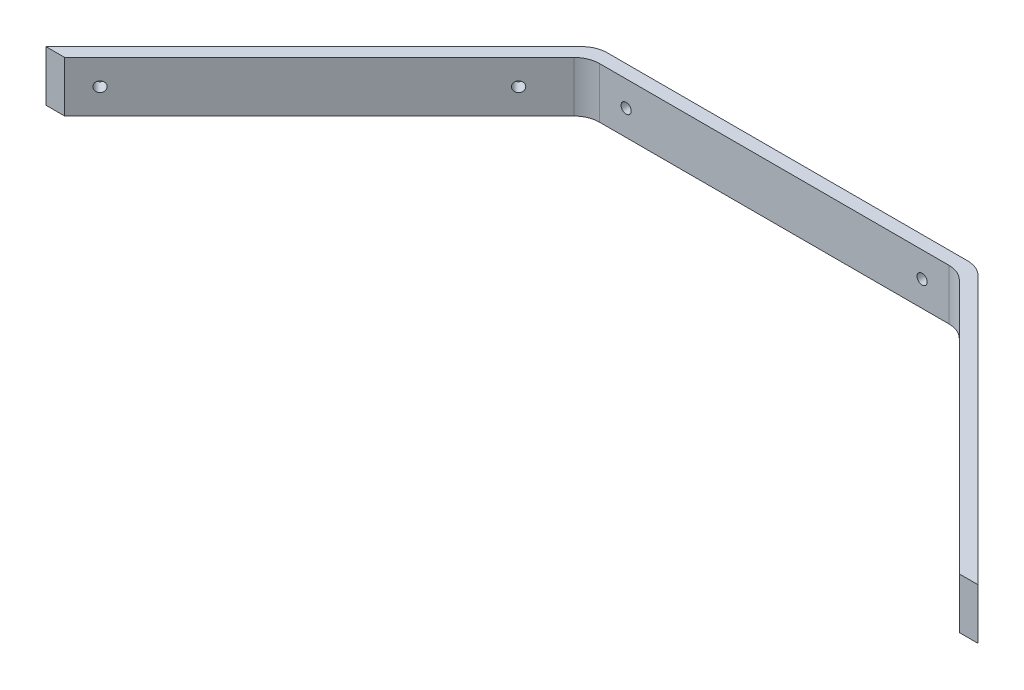
ISO-10303-21;
HEADER;
FILE_DESCRIPTION(('STEP AP214'),'2;1');
FILE_NAME('part.step','',(''),(''),'','','');
FILE_SCHEMA(('AUTOMOTIVE_DESIGN { 1 0 10303 214 1 1 1 1 }'));
ENDSEC;
DATA;
#1=APPLICATION_CONTEXT('core data for automotive mechanical design processes');
#2=APPLICATION_PROTOCOL_DEFINITION('international standard','automotive_design',2000,#1);
#3=PRODUCT_CONTEXT('',#1,'mechanical');
#4=PRODUCT('Part','Part','',(#3));
#5=PRODUCT_RELATED_PRODUCT_CATEGORY('part','',(#4));
#6=PRODUCT_DEFINITION_FORMATION('','',#4);
#7=PRODUCT_DEFINITION_CONTEXT('part definition',#1,'design');
#8=PRODUCT_DEFINITION('design','',#6,#7);
#9=PRODUCT_DEFINITION_SHAPE('','',#8);
#10=(LENGTH_UNIT() NAMED_UNIT(*) SI_UNIT(.MILLI.,.METRE.));
#11=(NAMED_UNIT(*) PLANE_ANGLE_UNIT() SI_UNIT($,.RADIAN.));
#12=(NAMED_UNIT(*) SI_UNIT($,.STERADIAN.) SOLID_ANGLE_UNIT());
#13=UNCERTAINTY_MEASURE_WITH_UNIT(LENGTH_MEASURE(1.E-05),#10,'distance_accuracy_value','');
#14=(GEOMETRIC_REPRESENTATION_CONTEXT(3) GLOBAL_UNCERTAINTY_ASSIGNED_CONTEXT((#13)) GLOBAL_UNIT_ASSIGNED_CONTEXT((#10,
#11,#12)) REPRESENTATION_CONTEXT('',''));
#15=CARTESIAN_POINT('',(0.,0.,0.));
#16=DIRECTION('',(0.,0.,1.));
#17=DIRECTION('',(1.,0.,0.));
#18=AXIS2_PLACEMENT_3D('',#15,#16,#17);
#19=CARTESIAN_POINT('',(23.1530667042611,-3.175,0.8255));
#20=DIRECTION('',(-0.707106781186549,0.,0.707106781186546));
#21=DIRECTION('',(0.707106781186546,0.,0.707106781186549));
#22=AXIS2_PLACEMENT_3D('',#19,#20,#21);
#23=PLANE('',#22);
#24=CARTESIAN_POINT('',(27.5478777942762,0.,5.22031109001511));
#25=DIRECTION('',(-0.707106781186549,0.,0.707106781186546));
#26=DIRECTION('',(0.707106781186546,0.,0.707106781186549));
#27=AXIS2_PLACEMENT_3D('',#24,#25,#26);
#28=CIRCLE('',#27,0.635000000000001);
#29=CARTESIAN_POINT('',(27.9968906003297,0.,5.66932389606857));
#30=VERTEX_POINT('',#29);
#31=EDGE_CURVE('E254',#30,#30,#28,.F.);
#32=ORIENTED_EDGE('',*,*,#31,.T.);
#33=EDGE_LOOP('',(#32));
#34=FACE_BOUND('',#33,.T.);
#35=DIRECTION('',(0.,-1.,0.));
#36=VECTOR('',#35,1.);
#37=CARTESIAN_POINT('',(55.919066704261,-3.175,33.5915));
#38=LINE('',#37,#36);
#39=CARTESIAN_POINT('',(55.919066704261,3.175,33.5915));
#40=VERTEX_POINT('',#39);
#41=CARTESIAN_POINT('',(55.919066704261,-3.175,33.5915));
#42=VERTEX_POINT('',#41);
#43=EDGE_CURVE('E122',#40,#42,#38,.T.);
#44=ORIENTED_EDGE('',*,*,#43,.F.);
#45=DIRECTION('',(0.707106781186546,0.,0.707106781186549));
#46=VECTOR('',#45,1.);
#47=CARTESIAN_POINT('',(23.1530667042611,3.175,0.8255));
#48=LINE('',#47,#46);
#49=CARTESIAN_POINT('',(24.0830026739939,3.175,1.75543596973271));
#50=VERTEX_POINT('',#49);
#51=EDGE_CURVE('E152',#50,#40,#48,.T.);
#52=ORIENTED_EDGE('',*,*,#51,.F.);
#53=DIRECTION('',(0.,-1.,0.));
#54=VECTOR('',#53,1.);
#55=CARTESIAN_POINT('',(24.0830026739939,-3.175,1.75543596973272));
#56=LINE('',#55,#54);
#57=CARTESIAN_POINT('',(24.0830026739939,-3.175,1.75543596973271));
#58=VERTEX_POINT('',#57);
#59=EDGE_CURVE('E147',#50,#58,#56,.T.);
#60=ORIENTED_EDGE('',*,*,#59,.T.);
#61=DIRECTION('',(0.707106781186546,0.,0.707106781186549));
#62=VECTOR('',#61,1.);
#63=CARTESIAN_POINT('',(23.1530667042611,-3.175,0.8255));
#64=LINE('',#63,#62);
#65=EDGE_CURVE('E208',#58,#42,#64,.T.);
#66=ORIENTED_EDGE('',*,*,#65,.T.);
#67=EDGE_LOOP('',(#44,#52,#60,#66));
#68=FACE_BOUND('',#67,.T.);
#69=CARTESIAN_POINT('',(53.7108286981784,0.,31.3832619939174));
#70=DIRECTION('',(-0.707106781186549,0.,0.707106781186546));
#71=DIRECTION('',(0.707106781186546,0.,0.707106781186549));
#72=AXIS2_PLACEMENT_3D('',#69,#70,#71);
#73=CIRCLE('',#72,0.634999999999996);
#74=CARTESIAN_POINT('',(54.1598415042319,0.,31.8322747999709));
#75=VERTEX_POINT('',#74);
#76=EDGE_CURVE('E260',#75,#75,#73,.F.);
#77=ORIENTED_EDGE('',*,*,#76,.T.);
#78=EDGE_LOOP('',(#77));
#79=FACE_BOUND('',#78,.T.);
#80=ADVANCED_FACE('F33',(#34,#68,#79),#23,.T.);
#81=CARTESIAN_POINT('',(23.8369332957391,-3.175,-0.825499999999999));
#82=DIRECTION('',(0.707106781186549,0.,-0.707106781186546));
#83=DIRECTION('',(-0.707106781186546,0.,-0.707106781186549));
#84=AXIS2_PLACEMENT_3D('',#81,#82,#83);
#85=PLANE('',#84);
#86=CARTESIAN_POINT('',(28.7153110900152,0.,4.05287779427612));
#87=DIRECTION('',(-0.707106781186549,0.,0.707106781186546));
#88=DIRECTION('',(0.707106781186546,0.,0.707106781186549));
#89=AXIS2_PLACEMENT_3D('',#86,#87,#88);
#90=CIRCLE('',#89,0.635000000000001);
#91=CARTESIAN_POINT('',(29.1643238960687,0.,4.50189060032958));
#92=VERTEX_POINT('',#91);
#93=EDGE_CURVE('E257',#92,#92,#90,.T.);
#94=ORIENTED_EDGE('',*,*,#93,.T.);
#95=EDGE_LOOP('',(#94));
#96=FACE_BOUND('',#95,.T.);
#97=DIRECTION('',(0.,-1.,0.));
#98=VECTOR('',#97,1.);
#99=CARTESIAN_POINT('',(58.2539332957391,162.970021260659,33.5915));
#100=LINE('',#99,#98);
#101=CARTESIAN_POINT('',(58.253933295739,3.175,33.5915));
#102=VERTEX_POINT('',#101);
#103=CARTESIAN_POINT('',(58.2539332957391,-3.17500000000001,33.5915));
#104=VERTEX_POINT('',#103);
#105=EDGE_CURVE('E48',#102,#104,#100,.T.);
#106=ORIENTED_EDGE('',*,*,#105,.T.);
#107=DIRECTION('',(0.707106781186546,0.,0.707106781186549));
#108=VECTOR('',#107,1.);
#109=CARTESIAN_POINT('',(23.8369332957391,-3.175,-0.825499999999999));
#110=LINE('',#109,#108);
#111=CARTESIAN_POINT('',(24.7668692654718,-3.175,0.104435969732715));
#112=VERTEX_POINT('',#111);
#113=EDGE_CURVE('E136',#112,#104,#110,.T.);
#114=ORIENTED_EDGE('',*,*,#113,.F.);
#115=DIRECTION('',(0.,1.,0.));
#116=VECTOR('',#115,1.);
#117=CARTESIAN_POINT('',(24.7668692654718,3.175,0.104435969732715));
#118=LINE('',#117,#116);
#119=CARTESIAN_POINT('',(24.7668692654718,3.175,0.104435969732715));
#120=VERTEX_POINT('',#119);
#121=EDGE_CURVE('E170',#112,#120,#118,.T.);
#122=ORIENTED_EDGE('',*,*,#121,.T.);
#123=DIRECTION('',(0.707106781186546,0.,0.707106781186549));
#124=VECTOR('',#123,1.);
#125=CARTESIAN_POINT('',(23.8369332957391,3.175,-0.825499999999999));
#126=LINE('',#125,#124);
#127=EDGE_CURVE('E139',#120,#102,#126,.T.);
#128=ORIENTED_EDGE('',*,*,#127,.T.);
#129=EDGE_LOOP('',(#106,#114,#122,#128));
#130=FACE_BOUND('',#129,.T.);
#131=CARTESIAN_POINT('',(54.8782619939174,0.,30.2158286981784));
#132=DIRECTION('',(-0.707106781186549,0.,0.707106781186546));
#133=DIRECTION('',(0.707106781186546,0.,0.707106781186549));
#134=AXIS2_PLACEMENT_3D('',#131,#132,#133);
#135=CIRCLE('',#134,0.634999999999996);
#136=CARTESIAN_POINT('',(55.3272747999709,0.,30.6648415042319));
#137=VERTEX_POINT('',#136);
#138=EDGE_CURVE('E263',#137,#137,#135,.T.);
#139=ORIENTED_EDGE('',*,*,#138,.T.);
#140=EDGE_LOOP('',(#139));
#141=FACE_BOUND('',#140,.T.);
#142=ADVANCED_FACE('F133',(#96,#130,#141),#85,.T.);
#143=CARTESIAN_POINT('',(-58.2539332957391,162.970021260659,33.5915));
#144=DIRECTION('',(0.,0.,-1.));
#145=DIRECTION('',(-1.,0.,0.));
#146=AXIS2_PLACEMENT_3D('',#143,#144,#145);
#147=PLANE('',#146);
#148=DIRECTION('',(-1.,0.,0.));
#149=VECTOR('',#148,1.);
#150=CARTESIAN_POINT('',(30.0561204073696,-3.175,33.5915));
#151=LINE('',#150,#149);
#152=EDGE_CURVE('E119',#104,#42,#151,.T.);
#153=ORIENTED_EDGE('',*,*,#152,.F.);
#154=ORIENTED_EDGE('',*,*,#105,.F.);
#155=DIRECTION('',(1.,0.,0.));
#156=VECTOR('',#155,1.);
#157=CARTESIAN_POINT('',(30.0561204073696,3.175,33.5915));
#158=LINE('',#157,#156);
#159=EDGE_CURVE('E218',#40,#102,#158,.T.);
#160=ORIENTED_EDGE('',*,*,#159,.F.);
#161=ORIENTED_EDGE('',*,*,#43,.T.);
#162=EDGE_LOOP('',(#153,#154,#160,#161));
#163=FACE_BOUND('',#162,.T.);
#164=ADVANCED_FACE('F120',(#163),#147,.F.);
#165=CARTESIAN_POINT('',(30.0561204073696,-3.175,0.8255));
#166=DIRECTION('',(0.,1.,0.));
#167=DIRECTION('',(0.,0.,1.));
#168=AXIS2_PLACEMENT_3D('',#165,#166,#167);
#169=PLANE('',#168);
#170=ORIENTED_EDGE('',*,*,#113,.T.);
#171=ORIENTED_EDGE('',*,*,#152,.T.);
#172=ORIENTED_EDGE('',*,*,#65,.F.);
#173=CARTESIAN_POINT('',(21.8379386437266,-3.175,4.0005));
#174=DIRECTION('',(0.,1.,0.));
#175=DIRECTION('',(0.,0.,1.));
#176=AXIS2_PLACEMENT_3D('',#173,#174,#175);
#177=CIRCLE('',#176,3.175);
#178=CARTESIAN_POINT('',(21.8379386437266,-3.175,0.8255));
#179=VERTEX_POINT('',#178);
#180=EDGE_CURVE('E162',#58,#179,#177,.T.);
#181=ORIENTED_EDGE('',*,*,#180,.T.);
#182=DIRECTION('',(-1.,0.,0.));
#183=VECTOR('',#182,1.);
#184=CARTESIAN_POINT('',(30.0561204073696,-3.175,0.8255));
#185=LINE('',#184,#183);
#186=CARTESIAN_POINT('',(-21.8379386437266,-3.175,0.8255));
#187=VERTEX_POINT('',#186);
#188=EDGE_CURVE('E213',#179,#187,#185,.T.);
#189=ORIENTED_EDGE('',*,*,#188,.T.);
#190=CARTESIAN_POINT('',(-21.8379386437266,-3.175,4.0005));
#191=DIRECTION('',(0.,1.,0.));
#192=DIRECTION('',(0.,0.,1.));
#193=AXIS2_PLACEMENT_3D('',#190,#191,#192);
#194=CIRCLE('',#193,3.175);
#195=CARTESIAN_POINT('',(-24.0830026739939,-3.175,1.75543596973271));
#196=VERTEX_POINT('',#195);
#197=EDGE_CURVE('E166',#187,#196,#194,.T.);
#198=ORIENTED_EDGE('',*,*,#197,.T.);
#199=DIRECTION('',(-0.707106781186546,0.,0.707106781186549));
#200=VECTOR('',#199,1.);
#201=CARTESIAN_POINT('',(-23.1530667042611,-3.175,0.8255));
#202=LINE('',#201,#200);
#203=CARTESIAN_POINT('',(-55.919066704261,-3.175,33.5915));
#204=VERTEX_POINT('',#203);
#205=EDGE_CURVE('E127',#196,#204,#202,.T.);
#206=ORIENTED_EDGE('',*,*,#205,.T.);
#207=CARTESIAN_POINT('',(-58.2539332957391,-3.17500000000001,33.5915));
#208=VERTEX_POINT('',#207);
#209=EDGE_CURVE('E129',#204,#208,#151,.T.);
#210=ORIENTED_EDGE('',*,*,#209,.T.);
#211=DIRECTION('',(-0.707106781186546,0.,0.707106781186549));
#212=VECTOR('',#211,1.);
#213=CARTESIAN_POINT('',(-23.8369332957391,-3.175,-0.825499999999999));
#214=LINE('',#213,#212);
#215=CARTESIAN_POINT('',(-24.7668692654718,-3.175,0.104435969732715));
#216=VERTEX_POINT('',#215);
#217=EDGE_CURVE('E189',#216,#208,#214,.T.);
#218=ORIENTED_EDGE('',*,*,#217,.F.);
#219=CARTESIAN_POINT('',(-22.5218052352045,-3.175,2.3495));
#220=DIRECTION('',(0.,1.,0.));
#221=DIRECTION('',(0.,0.,1.));
#222=AXIS2_PLACEMENT_3D('',#219,#220,#221);
#223=CIRCLE('',#222,3.175);
#224=CARTESIAN_POINT('',(-22.5218052352045,-3.175,-0.825499999999999));
#225=VERTEX_POINT('',#224);
#226=EDGE_CURVE('E181',#216,#225,#223,.F.);
#227=ORIENTED_EDGE('',*,*,#226,.T.);
#228=DIRECTION('',(-1.,0.,0.));
#229=VECTOR('',#228,1.);
#230=CARTESIAN_POINT('',(30.0561204073696,-3.175,-0.825499999999999));
#231=LINE('',#230,#229);
#232=CARTESIAN_POINT('',(22.5218052352045,-3.175,-0.825499999999999));
#233=VERTEX_POINT('',#232);
#234=EDGE_CURVE('E205',#233,#225,#231,.T.);
#235=ORIENTED_EDGE('',*,*,#234,.F.);
#236=CARTESIAN_POINT('',(22.5218052352045,-3.175,2.3495));
#237=DIRECTION('',(0.,1.,0.));
#238=DIRECTION('',(0.,0.,1.));
#239=AXIS2_PLACEMENT_3D('',#236,#237,#238);
#240=CIRCLE('',#239,3.175);
#241=EDGE_CURVE('E146',#233,#112,#240,.F.);
#242=ORIENTED_EDGE('',*,*,#241,.T.);
#243=EDGE_LOOP('',(#170,#171,#172,#181,#189,#198,#206,#210,#218,#227,#235,#242));
#244=FACE_BOUND('',#243,.T.);
#245=ADVANCED_FACE('F143',(#244),#169,.F.);
#246=CARTESIAN_POINT('',(30.0561204073696,-3.175,0.8255));
#247=DIRECTION('',(0.,0.,-1.));
#248=DIRECTION('',(-1.,0.,0.));
#249=AXIS2_PLACEMENT_3D('',#246,#247,#248);
#250=PLANE('',#249);
#251=CARTESIAN_POINT('',(-18.5,0.,0.8255));
#252=DIRECTION('',(0.,0.,-1.));
#253=DIRECTION('',(-1.,0.,0.));
#254=AXIS2_PLACEMENT_3D('',#251,#252,#253);
#255=CIRCLE('',#254,0.634999999999999);
#256=CARTESIAN_POINT('',(-19.135,0.,0.8255));
#257=VERTEX_POINT('',#256);
#258=EDGE_CURVE('E272',#257,#257,#255,.T.);
#259=ORIENTED_EDGE('',*,*,#258,.T.);
#260=EDGE_LOOP('',(#259));
#261=FACE_BOUND('',#260,.T.);
#262=CARTESIAN_POINT('',(18.5,0.,0.8255));
#263=DIRECTION('',(0.,0.,-1.));
#264=DIRECTION('',(-1.,0.,0.));
#265=AXIS2_PLACEMENT_3D('',#262,#263,#264);
#266=CIRCLE('',#265,0.634999999999999);
#267=CARTESIAN_POINT('',(17.865,0.,0.8255));
#268=VERTEX_POINT('',#267);
#269=EDGE_CURVE('E266',#268,#268,#266,.T.);
#270=ORIENTED_EDGE('',*,*,#269,.T.);
#271=EDGE_LOOP('',(#270));
#272=FACE_BOUND('',#271,.T.);
#273=ORIENTED_EDGE('',*,*,#188,.F.);
#274=DIRECTION('',(0.,-1.,0.));
#275=VECTOR('',#274,1.);
#276=CARTESIAN_POINT('',(21.8379386437266,-3.175,0.8255));
#277=LINE('',#276,#275);
#278=CARTESIAN_POINT('',(21.8379386437266,3.175,0.8255));
#279=VERTEX_POINT('',#278);
#280=EDGE_CURVE('E158',#179,#279,#277,.F.);
#281=ORIENTED_EDGE('',*,*,#280,.T.);
#282=DIRECTION('',(-1.,0.,0.));
#283=VECTOR('',#282,1.);
#284=CARTESIAN_POINT('',(30.0561204073696,3.175,0.8255));
#285=LINE('',#284,#283);
#286=CARTESIAN_POINT('',(-21.8379386437266,3.175,0.8255));
#287=VERTEX_POINT('',#286);
#288=EDGE_CURVE('E209',#279,#287,#285,.T.);
#289=ORIENTED_EDGE('',*,*,#288,.T.);
#290=DIRECTION('',(0.,-1.,0.));
#291=VECTOR('',#290,1.);
#292=CARTESIAN_POINT('',(-21.8379386437266,-3.175,0.8255));
#293=LINE('',#292,#291);
#294=EDGE_CURVE('E150',#287,#187,#293,.T.);
#295=ORIENTED_EDGE('',*,*,#294,.T.);
#296=EDGE_LOOP('',(#273,#281,#289,#295));
#297=FACE_BOUND('',#296,.T.);
#298=ADVANCED_FACE('F230',(#261,#272,#297),#250,.F.);
#299=CARTESIAN_POINT('',(30.0561204073696,3.175,0.8255));
#300=DIRECTION('',(0.,-1.,0.));
#301=DIRECTION('',(0.,0.,-1.));
#302=AXIS2_PLACEMENT_3D('',#299,#300,#301);
#303=PLANE('',#302);
#304=DIRECTION('',(-0.707106781186546,0.,0.707106781186549));
#305=VECTOR('',#304,1.);
#306=CARTESIAN_POINT('',(-23.8369332957391,3.175,-0.825499999999999));
#307=LINE('',#306,#305);
#308=CARTESIAN_POINT('',(-24.7668692654718,3.175,0.104435969732715));
#309=VERTEX_POINT('',#308);
#310=CARTESIAN_POINT('',(-58.253933295739,3.175,33.5915));
#311=VERTEX_POINT('',#310);
#312=EDGE_CURVE('E191',#309,#311,#307,.T.);
#313=ORIENTED_EDGE('',*,*,#312,.T.);
#314=CARTESIAN_POINT('',(-55.919066704261,3.175,33.5915));
#315=VERTEX_POINT('',#314);
#316=EDGE_CURVE('E56',#311,#315,#158,.T.);
#317=ORIENTED_EDGE('',*,*,#316,.T.);
#318=DIRECTION('',(-0.707106781186546,0.,0.707106781186549));
#319=VECTOR('',#318,1.);
#320=CARTESIAN_POINT('',(-23.1530667042611,3.175,0.8255));
#321=LINE('',#320,#319);
#322=CARTESIAN_POINT('',(-24.0830026739939,3.175,1.75543596973271));
#323=VERTEX_POINT('',#322);
#324=EDGE_CURVE('E232',#323,#315,#321,.T.);
#325=ORIENTED_EDGE('',*,*,#324,.F.);
#326=CARTESIAN_POINT('',(-21.8379386437266,3.175,4.0005));
#327=DIRECTION('',(0.,-1.,0.));
#328=DIRECTION('',(0.,0.,-1.));
#329=AXIS2_PLACEMENT_3D('',#326,#327,#328);
#330=CIRCLE('',#329,3.175);
#331=EDGE_CURVE('E168',#323,#287,#330,.T.);
#332=ORIENTED_EDGE('',*,*,#331,.T.);
#333=ORIENTED_EDGE('',*,*,#288,.F.);
#334=CARTESIAN_POINT('',(21.8379386437266,3.175,4.0005));
#335=DIRECTION('',(0.,-1.,0.));
#336=DIRECTION('',(0.,0.,-1.));
#337=AXIS2_PLACEMENT_3D('',#334,#335,#336);
#338=CIRCLE('',#337,3.175);
#339=EDGE_CURVE('E164',#279,#50,#338,.T.);
#340=ORIENTED_EDGE('',*,*,#339,.T.);
#341=ORIENTED_EDGE('',*,*,#51,.T.);
#342=ORIENTED_EDGE('',*,*,#159,.T.);
#343=ORIENTED_EDGE('',*,*,#127,.F.);
#344=CARTESIAN_POINT('',(22.5218052352045,3.175,2.3495));
#345=DIRECTION('',(0.,-1.,0.));
#346=DIRECTION('',(0.,0.,-1.));
#347=AXIS2_PLACEMENT_3D('',#344,#345,#346);
#348=CIRCLE('',#347,3.175);
#349=CARTESIAN_POINT('',(22.5218052352045,3.175,-0.825499999999999));
#350=VERTEX_POINT('',#349);
#351=EDGE_CURVE('E174',#120,#350,#348,.F.);
#352=ORIENTED_EDGE('',*,*,#351,.T.);
#353=DIRECTION('',(-1.,0.,0.));
#354=VECTOR('',#353,1.);
#355=CARTESIAN_POINT('',(30.0561204073696,3.175,-0.825499999999999));
#356=LINE('',#355,#354);
#357=CARTESIAN_POINT('',(-22.5218052352045,3.175,-0.825499999999999));
#358=VERTEX_POINT('',#357);
#359=EDGE_CURVE('E203',#350,#358,#356,.T.);
#360=ORIENTED_EDGE('',*,*,#359,.T.);
#361=CARTESIAN_POINT('',(-22.5218052352045,3.175,2.3495));
#362=DIRECTION('',(0.,-1.,0.));
#363=DIRECTION('',(0.,0.,-1.));
#364=AXIS2_PLACEMENT_3D('',#361,#362,#363);
#365=CIRCLE('',#364,3.175);
#366=EDGE_CURVE('E172',#358,#309,#365,.F.);
#367=ORIENTED_EDGE('',*,*,#366,.T.);
#368=EDGE_LOOP('',(#313,#317,#325,#332,#333,#340,#341,#342,#343,#352,#360,#367));
#369=FACE_BOUND('',#368,.T.);
#370=ADVANCED_FACE('F207',(#369),#303,.F.);
#371=CARTESIAN_POINT('',(30.0561204073696,-3.175,-0.825499999999999));
#372=DIRECTION('',(0.,0.,1.));
#373=DIRECTION('',(1.,0.,0.));
#374=AXIS2_PLACEMENT_3D('',#371,#372,#373);
#375=PLANE('',#374);
#376=CARTESIAN_POINT('',(-18.5,0.,-0.825499999999999));
#377=DIRECTION('',(0.,0.,-1.));
#378=DIRECTION('',(-1.,0.,0.));
#379=AXIS2_PLACEMENT_3D('',#376,#377,#378);
#380=CIRCLE('',#379,0.634999999999999);
#381=CARTESIAN_POINT('',(-19.135,0.,-0.825499999999999));
#382=VERTEX_POINT('',#381);
#383=EDGE_CURVE('E275',#382,#382,#380,.T.);
#384=ORIENTED_EDGE('',*,*,#383,.F.);
#385=EDGE_LOOP('',(#384));
#386=FACE_BOUND('',#385,.T.);
#387=CARTESIAN_POINT('',(18.5,0.,-0.825499999999999));
#388=DIRECTION('',(0.,0.,-1.));
#389=DIRECTION('',(-1.,0.,0.));
#390=AXIS2_PLACEMENT_3D('',#387,#388,#389);
#391=CIRCLE('',#390,0.634999999999999);
#392=CARTESIAN_POINT('',(17.865,0.,-0.825499999999999));
#393=VERTEX_POINT('',#392);
#394=EDGE_CURVE('E269',#393,#393,#391,.T.);
#395=ORIENTED_EDGE('',*,*,#394,.F.);
#396=EDGE_LOOP('',(#395));
#397=FACE_BOUND('',#396,.T.);
#398=ORIENTED_EDGE('',*,*,#359,.F.);
#399=DIRECTION('',(0.,1.,0.));
#400=VECTOR('',#399,1.);
#401=CARTESIAN_POINT('',(22.5218052352045,-3.175,-0.825499999999999));
#402=LINE('',#401,#400);
#403=EDGE_CURVE('E179',#350,#233,#402,.F.);
#404=ORIENTED_EDGE('',*,*,#403,.T.);
#405=ORIENTED_EDGE('',*,*,#234,.T.);
#406=DIRECTION('',(0.,1.,0.));
#407=VECTOR('',#406,1.);
#408=CARTESIAN_POINT('',(-22.5218052352045,-3.175,-0.825499999999999));
#409=LINE('',#408,#407);
#410=EDGE_CURVE('E176',#225,#358,#409,.T.);
#411=ORIENTED_EDGE('',*,*,#410,.T.);
#412=EDGE_LOOP('',(#398,#404,#405,#411));
#413=FACE_BOUND('',#412,.T.);
#414=ADVANCED_FACE('F202',(#386,#397,#413),#375,.F.);
#415=CARTESIAN_POINT('',(-23.1530667042611,-3.175,0.8255));
#416=DIRECTION('',(-0.707106781186549,0.,-0.707106781186546));
#417=DIRECTION('',(-0.707106781186546,0.,0.707106781186549));
#418=AXIS2_PLACEMENT_3D('',#415,#416,#417);
#419=PLANE('',#418);
#420=CARTESIAN_POINT('',(-53.7108286981784,0.,31.3832619939174));
#421=DIRECTION('',(-0.707106781186549,0.,-0.707106781186546));
#422=DIRECTION('',(-0.707106781186546,0.,0.707106781186549));
#423=AXIS2_PLACEMENT_3D('',#420,#421,#422);
#424=CIRCLE('',#423,0.634999999999996);
#425=CARTESIAN_POINT('',(-54.1598415042319,0.,31.8322747999709));
#426=VERTEX_POINT('',#425);
#427=EDGE_CURVE('E248',#426,#426,#424,.T.);
#428=ORIENTED_EDGE('',*,*,#427,.T.);
#429=EDGE_LOOP('',(#428));
#430=FACE_BOUND('',#429,.T.);
#431=CARTESIAN_POINT('',(-27.5478777942762,0.,5.22031109001511));
#432=DIRECTION('',(-0.707106781186549,0.,-0.707106781186546));
#433=DIRECTION('',(-0.707106781186546,0.,0.707106781186549));
#434=AXIS2_PLACEMENT_3D('',#431,#432,#433);
#435=CIRCLE('',#434,0.635000000000001);
#436=CARTESIAN_POINT('',(-27.9968906003297,0.,5.66932389606857));
#437=VERTEX_POINT('',#436);
#438=EDGE_CURVE('E141',#437,#437,#435,.T.);
#439=ORIENTED_EDGE('',*,*,#438,.T.);
#440=EDGE_LOOP('',(#439));
#441=FACE_BOUND('',#440,.T.);
#442=ORIENTED_EDGE('',*,*,#324,.T.);
#443=DIRECTION('',(0.,-1.,0.));
#444=VECTOR('',#443,1.);
#445=CARTESIAN_POINT('',(-55.919066704261,-3.175,33.5915));
#446=LINE('',#445,#444);
#447=EDGE_CURVE('E140',#315,#204,#446,.T.);
#448=ORIENTED_EDGE('',*,*,#447,.T.);
#449=ORIENTED_EDGE('',*,*,#205,.F.);
#450=DIRECTION('',(0.,-1.,0.));
#451=VECTOR('',#450,1.);
#452=CARTESIAN_POINT('',(-24.0830026739939,3.175,1.75543596973271));
#453=LINE('',#452,#451);
#454=EDGE_CURVE('E160',#196,#323,#453,.F.);
#455=ORIENTED_EDGE('',*,*,#454,.T.);
#456=EDGE_LOOP('',(#442,#448,#449,#455));
#457=FACE_BOUND('',#456,.T.);
#458=ADVANCED_FACE('F284',(#430,#441,#457),#419,.F.);
#459=CARTESIAN_POINT('',(-23.8369332957391,-3.175,-0.825499999999999));
#460=DIRECTION('',(0.707106781186549,0.,0.707106781186546));
#461=DIRECTION('',(0.707106781186546,0.,-0.707106781186549));
#462=AXIS2_PLACEMENT_3D('',#459,#460,#461);
#463=PLANE('',#462);
#464=CARTESIAN_POINT('',(-54.8782619939174,0.,30.2158286981784));
#465=DIRECTION('',(-0.707106781186549,0.,-0.707106781186546));
#466=DIRECTION('',(-0.707106781186546,0.,0.707106781186549));
#467=AXIS2_PLACEMENT_3D('',#464,#465,#466);
#468=CIRCLE('',#467,0.634999999999996);
#469=CARTESIAN_POINT('',(-55.3272747999709,0.,30.6648415042319));
#470=VERTEX_POINT('',#469);
#471=EDGE_CURVE('E251',#470,#470,#468,.T.);
#472=ORIENTED_EDGE('',*,*,#471,.F.);
#473=EDGE_LOOP('',(#472));
#474=FACE_BOUND('',#473,.T.);
#475=CARTESIAN_POINT('',(-28.7153110900152,0.,4.05287779427612));
#476=DIRECTION('',(-0.707106781186549,0.,-0.707106781186546));
#477=DIRECTION('',(-0.707106781186546,0.,0.707106781186549));
#478=AXIS2_PLACEMENT_3D('',#475,#476,#477);
#479=CIRCLE('',#478,0.635000000000001);
#480=CARTESIAN_POINT('',(-29.1643238960687,0.,4.50189060032958));
#481=VERTEX_POINT('',#480);
#482=EDGE_CURVE('E245',#481,#481,#479,.T.);
#483=ORIENTED_EDGE('',*,*,#482,.F.);
#484=EDGE_LOOP('',(#483));
#485=FACE_BOUND('',#484,.T.);
#486=ORIENTED_EDGE('',*,*,#217,.T.);
#487=DIRECTION('',(0.,1.,0.));
#488=VECTOR('',#487,1.);
#489=CARTESIAN_POINT('',(-58.253933295739,-3.175,33.5915));
#490=LINE('',#489,#488);
#491=EDGE_CURVE('E12',#208,#311,#490,.T.);
#492=ORIENTED_EDGE('',*,*,#491,.T.);
#493=ORIENTED_EDGE('',*,*,#312,.F.);
#494=DIRECTION('',(0.,1.,0.));
#495=VECTOR('',#494,1.);
#496=CARTESIAN_POINT('',(-24.7668692654718,-3.175,0.104435969732715));
#497=LINE('',#496,#495);
#498=EDGE_CURVE('E41',#309,#216,#497,.F.);
#499=ORIENTED_EDGE('',*,*,#498,.T.);
#500=EDGE_LOOP('',(#486,#492,#493,#499));
#501=FACE_BOUND('',#500,.T.);
#502=ADVANCED_FACE('F188',(#474,#485,#501),#463,.F.);
#503=CARTESIAN_POINT('',(21.8379386437266,-3.175,4.0005));
#504=DIRECTION('',(0.,-1.,0.));
#505=DIRECTION('',(0.,0.,-1.));
#506=AXIS2_PLACEMENT_3D('',#503,#504,#505);
#507=CYLINDRICAL_SURFACE('',#506,3.175);
#508=ORIENTED_EDGE('',*,*,#339,.F.);
#509=ORIENTED_EDGE('',*,*,#280,.F.);
#510=ORIENTED_EDGE('',*,*,#180,.F.);
#511=ORIENTED_EDGE('',*,*,#59,.F.);
#512=EDGE_LOOP('',(#508,#509,#510,#511));
#513=FACE_BOUND('',#512,.T.);
#514=ADVANCED_FACE('F225',(#513),#507,.F.);
#515=CARTESIAN_POINT('',(-21.8379386437266,-3.175,4.0005));
#516=DIRECTION('',(0.,1.,0.));
#517=DIRECTION('',(0.,0.,1.));
#518=AXIS2_PLACEMENT_3D('',#515,#516,#517);
#519=CYLINDRICAL_SURFACE('',#518,3.175);
#520=ORIENTED_EDGE('',*,*,#331,.F.);
#521=ORIENTED_EDGE('',*,*,#454,.F.);
#522=ORIENTED_EDGE('',*,*,#197,.F.);
#523=ORIENTED_EDGE('',*,*,#294,.F.);
#524=EDGE_LOOP('',(#520,#521,#522,#523));
#525=FACE_BOUND('',#524,.T.);
#526=ADVANCED_FACE('F315',(#525),#519,.F.);
#527=CARTESIAN_POINT('',(22.5218052352045,-3.175,2.3495));
#528=DIRECTION('',(0.,-1.,0.));
#529=DIRECTION('',(0.,0.,-1.));
#530=AXIS2_PLACEMENT_3D('',#527,#528,#529);
#531=CYLINDRICAL_SURFACE('',#530,3.175);
#532=ORIENTED_EDGE('',*,*,#241,.F.);
#533=ORIENTED_EDGE('',*,*,#403,.F.);
#534=ORIENTED_EDGE('',*,*,#351,.F.);
#535=ORIENTED_EDGE('',*,*,#121,.F.);
#536=EDGE_LOOP('',(#532,#533,#534,#535));
#537=FACE_BOUND('',#536,.T.);
#538=ADVANCED_FACE('F317',(#537),#531,.T.);
#539=CARTESIAN_POINT('',(-22.5218052352045,-3.175,2.3495));
#540=DIRECTION('',(0.,1.,0.));
#541=DIRECTION('',(0.,0.,1.));
#542=AXIS2_PLACEMENT_3D('',#539,#540,#541);
#543=CYLINDRICAL_SURFACE('',#542,3.175);
#544=ORIENTED_EDGE('',*,*,#226,.F.);
#545=ORIENTED_EDGE('',*,*,#498,.F.);
#546=ORIENTED_EDGE('',*,*,#366,.F.);
#547=ORIENTED_EDGE('',*,*,#410,.F.);
#548=EDGE_LOOP('',(#544,#545,#546,#547));
#549=FACE_BOUND('',#548,.T.);
#550=ADVANCED_FACE('F35',(#549),#543,.T.);
#551=ORIENTED_EDGE('',*,*,#209,.F.);
#552=ORIENTED_EDGE('',*,*,#447,.F.);
#553=ORIENTED_EDGE('',*,*,#316,.F.);
#554=ORIENTED_EDGE('',*,*,#491,.F.);
#555=EDGE_LOOP('',(#551,#552,#553,#554));
#556=FACE_BOUND('',#555,.T.);
#557=ADVANCED_FACE('F324',(#556),#147,.F.);
#558=CARTESIAN_POINT('',(29.538622205724,0.,62.3068110900152));
#559=DIRECTION('',(-0.707106781186549,0.,-0.707106781186546));
#560=DIRECTION('',(-0.707106781186546,0.,0.707106781186549));
#561=AXIS2_PLACEMENT_3D('',#558,#559,#560);
#562=CYLINDRICAL_SURFACE('',#561,0.635000000000001);
#563=ORIENTED_EDGE('',*,*,#482,.T.);
#564=EDGE_LOOP('',(#563));
#565=FACE_BOUND('',#564,.T.);
#566=ORIENTED_EDGE('',*,*,#438,.F.);
#567=EDGE_LOOP('',(#566));
#568=FACE_BOUND('',#567,.T.);
#569=ADVANCED_FACE('F328',(#565,#568),#562,.F.);
#570=CARTESIAN_POINT('',(3.37567130182184,0.,88.4697619939175));
#571=DIRECTION('',(-0.707106781186549,0.,-0.707106781186546));
#572=DIRECTION('',(-0.707106781186546,0.,0.707106781186549));
#573=AXIS2_PLACEMENT_3D('',#570,#571,#572);
#574=CYLINDRICAL_SURFACE('',#573,0.634999999999996);
#575=ORIENTED_EDGE('',*,*,#471,.T.);
#576=EDGE_LOOP('',(#575));
#577=FACE_BOUND('',#576,.T.);
#578=ORIENTED_EDGE('',*,*,#427,.F.);
#579=EDGE_LOOP('',(#578));
#580=FACE_BOUND('',#579,.T.);
#581=ADVANCED_FACE('F333',(#577,#580),#574,.F.);
#582=CARTESIAN_POINT('',(-29.538622205724,0.,62.3068110900152));
#583=DIRECTION('',(0.707106781186549,0.,-0.707106781186546));
#584=DIRECTION('',(-0.707106781186546,0.,-0.707106781186549));
#585=AXIS2_PLACEMENT_3D('',#582,#583,#584);
#586=CYLINDRICAL_SURFACE('',#585,0.635000000000001);
#587=ORIENTED_EDGE('',*,*,#31,.F.);
#588=EDGE_LOOP('',(#587));
#589=FACE_BOUND('',#588,.T.);
#590=ORIENTED_EDGE('',*,*,#93,.F.);
#591=EDGE_LOOP('',(#590));
#592=FACE_BOUND('',#591,.T.);
#593=ADVANCED_FACE('F392',(#589,#592),#586,.F.);
#594=CARTESIAN_POINT('',(-3.37567130182184,0.,88.4697619939175));
#595=DIRECTION('',(0.707106781186549,0.,-0.707106781186546));
#596=DIRECTION('',(-0.707106781186546,0.,-0.707106781186549));
#597=AXIS2_PLACEMENT_3D('',#594,#595,#596);
#598=CYLINDRICAL_SURFACE('',#597,0.634999999999996);
#599=ORIENTED_EDGE('',*,*,#76,.F.);
#600=EDGE_LOOP('',(#599));
#601=FACE_BOUND('',#600,.T.);
#602=ORIENTED_EDGE('',*,*,#138,.F.);
#603=EDGE_LOOP('',(#602));
#604=FACE_BOUND('',#603,.T.);
#605=ADVANCED_FACE('F291',(#601,#604),#598,.F.);
#606=CARTESIAN_POINT('',(18.5,0.,33.5915));
#607=DIRECTION('',(0.,0.,-1.));
#608=DIRECTION('',(-1.,0.,0.));
#609=AXIS2_PLACEMENT_3D('',#606,#607,#608);
#610=CYLINDRICAL_SURFACE('',#609,0.634999999999999);
#611=ORIENTED_EDGE('',*,*,#394,.T.);
#612=EDGE_LOOP('',(#611));
#613=FACE_BOUND('',#612,.T.);
#614=ORIENTED_EDGE('',*,*,#269,.F.);
#615=EDGE_LOOP('',(#614));
#616=FACE_BOUND('',#615,.T.);
#617=ADVANCED_FACE('F288',(#613,#616),#610,.F.);
#618=CARTESIAN_POINT('',(-18.5,0.,33.5915));
#619=DIRECTION('',(0.,0.,-1.));
#620=DIRECTION('',(-1.,0.,0.));
#621=AXIS2_PLACEMENT_3D('',#618,#619,#620);
#622=CYLINDRICAL_SURFACE('',#621,0.634999999999999);
#623=ORIENTED_EDGE('',*,*,#383,.T.);
#624=EDGE_LOOP('',(#623));
#625=FACE_BOUND('',#624,.T.);
#626=ORIENTED_EDGE('',*,*,#258,.F.);
#627=EDGE_LOOP('',(#626));
#628=FACE_BOUND('',#627,.T.);
#629=ADVANCED_FACE('F279',(#625,#628),#622,.F.);
#630=CLOSED_SHELL('',(#80,#142,#164,#245,#298,#370,#414,#458,#502,#514,#526,#538,#550,#557,#569,
#581,#593,#605,#617,#629));
#631=MANIFOLD_SOLID_BREP('B2',#630);
#632=ADVANCED_BREP_SHAPE_REPRESENTATION('',(#18,#631),#14);
#633=SHAPE_DEFINITION_REPRESENTATION(#9,#632);
ENDSEC;
END-ISO-10303-21;
